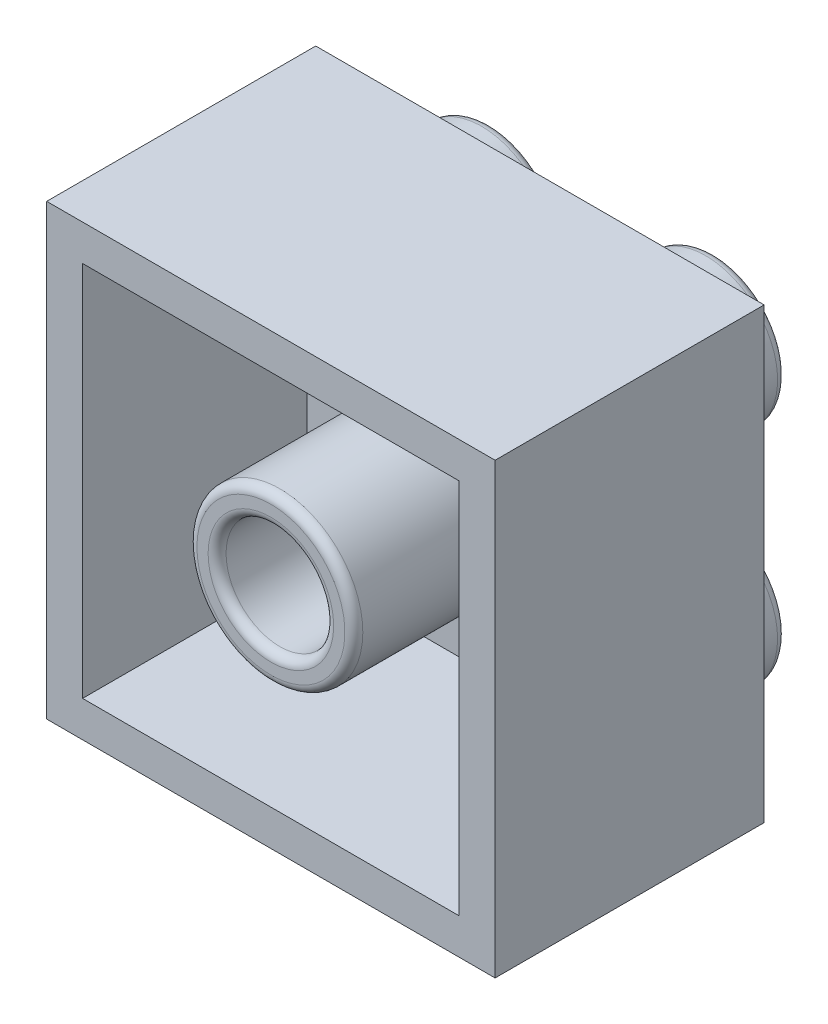
ISO-10303-21;
HEADER;
FILE_DESCRIPTION(('STEP AP214'),'2;1');
FILE_NAME('part.step','',(''),(''),'','','');
FILE_SCHEMA(('AUTOMOTIVE_DESIGN { 1 0 10303 214 1 1 1 1 }'));
ENDSEC;
DATA;
#1=APPLICATION_CONTEXT('core data for automotive mechanical design processes');
#2=APPLICATION_PROTOCOL_DEFINITION('international standard','automotive_design',2000,#1);
#3=PRODUCT_CONTEXT('',#1,'mechanical');
#4=PRODUCT('Part','Part','',(#3));
#5=PRODUCT_RELATED_PRODUCT_CATEGORY('part','',(#4));
#6=PRODUCT_DEFINITION_FORMATION('','',#4);
#7=PRODUCT_DEFINITION_CONTEXT('part definition',#1,'design');
#8=PRODUCT_DEFINITION('design','',#6,#7);
#9=PRODUCT_DEFINITION_SHAPE('','',#8);
#10=(LENGTH_UNIT() NAMED_UNIT(*) SI_UNIT(.MILLI.,.METRE.));
#11=(NAMED_UNIT(*) PLANE_ANGLE_UNIT() SI_UNIT($,.RADIAN.));
#12=(NAMED_UNIT(*) SI_UNIT($,.STERADIAN.) SOLID_ANGLE_UNIT());
#13=UNCERTAINTY_MEASURE_WITH_UNIT(LENGTH_MEASURE(1.E-05),#10,'distance_accuracy_value','');
#14=(GEOMETRIC_REPRESENTATION_CONTEXT(3) GLOBAL_UNCERTAINTY_ASSIGNED_CONTEXT((#13)) GLOBAL_UNIT_ASSIGNED_CONTEXT((#10,
#11,#12)) REPRESENTATION_CONTEXT('',''));
#15=CARTESIAN_POINT('',(0.,0.,0.));
#16=DIRECTION('',(0.,0.,1.));
#17=DIRECTION('',(1.,0.,0.));
#18=AXIS2_PLACEMENT_3D('',#15,#16,#17);
#19=CARTESIAN_POINT('',(0.,0.,60.));
#20=DIRECTION('',(0.,0.,-1.));
#21=DIRECTION('',(-1.,0.,0.));
#22=AXIS2_PLACEMENT_3D('',#19,#20,#21);
#23=PLANE('',#22);
#24=DIRECTION('',(-1.,0.,0.));
#25=VECTOR('',#24,1.);
#26=CARTESIAN_POINT('',(50.,-50.,60.));
#27=LINE('',#26,#25);
#28=CARTESIAN_POINT('',(50.,-50.,60.));
#29=VERTEX_POINT('',#28);
#30=CARTESIAN_POINT('',(-50.,-50.,60.));
#31=VERTEX_POINT('',#30);
#32=EDGE_CURVE('E180',#29,#31,#27,.T.);
#33=ORIENTED_EDGE('',*,*,#32,.F.);
#34=DIRECTION('',(0.,-1.,0.));
#35=VECTOR('',#34,1.);
#36=CARTESIAN_POINT('',(50.,50.,60.));
#37=LINE('',#36,#35);
#38=CARTESIAN_POINT('',(50.,50.,60.));
#39=VERTEX_POINT('',#38);
#40=EDGE_CURVE('E191',#39,#29,#37,.T.);
#41=ORIENTED_EDGE('',*,*,#40,.F.);
#42=DIRECTION('',(1.,0.,0.));
#43=VECTOR('',#42,1.);
#44=CARTESIAN_POINT('',(-50.,50.,60.));
#45=LINE('',#44,#43);
#46=CARTESIAN_POINT('',(-50.,50.,60.));
#47=VERTEX_POINT('',#46);
#48=EDGE_CURVE('E187',#47,#39,#45,.T.);
#49=ORIENTED_EDGE('',*,*,#48,.F.);
#50=DIRECTION('',(0.,1.,0.));
#51=VECTOR('',#50,1.);
#52=CARTESIAN_POINT('',(-50.,-50.,60.));
#53=LINE('',#52,#51);
#54=EDGE_CURVE('E183',#31,#47,#53,.T.);
#55=ORIENTED_EDGE('',*,*,#54,.F.);
#56=EDGE_LOOP('',(#33,#41,#49,#55));
#57=FACE_BOUND('',#56,.T.);
#58=DIRECTION('',(-1.,0.,0.));
#59=VECTOR('',#58,1.);
#60=CARTESIAN_POINT('',(0.,-42.,60.));
#61=LINE('',#60,#59);
#62=CARTESIAN_POINT('',(42.,-42.,60.));
#63=VERTEX_POINT('',#62);
#64=CARTESIAN_POINT('',(-42.,-42.,60.));
#65=VERTEX_POINT('',#64);
#66=EDGE_CURVE('E70',#63,#65,#61,.T.);
#67=ORIENTED_EDGE('',*,*,#66,.T.);
#68=DIRECTION('',(0.,1.,0.));
#69=VECTOR('',#68,1.);
#70=CARTESIAN_POINT('',(-42.,0.,60.));
#71=LINE('',#70,#69);
#72=CARTESIAN_POINT('',(-42.,42.,60.));
#73=VERTEX_POINT('',#72);
#74=EDGE_CURVE('E152',#65,#73,#71,.T.);
#75=ORIENTED_EDGE('',*,*,#74,.T.);
#76=DIRECTION('',(1.,0.,0.));
#77=VECTOR('',#76,1.);
#78=CARTESIAN_POINT('',(0.,42.,60.));
#79=LINE('',#78,#77);
#80=CARTESIAN_POINT('',(42.,42.,60.));
#81=VERTEX_POINT('',#80);
#82=EDGE_CURVE('E156',#73,#81,#79,.T.);
#83=ORIENTED_EDGE('',*,*,#82,.T.);
#84=DIRECTION('',(0.,-1.,0.));
#85=VECTOR('',#84,1.);
#86=CARTESIAN_POINT('',(42.,0.,60.));
#87=LINE('',#86,#85);
#88=EDGE_CURVE('E165',#81,#63,#87,.T.);
#89=ORIENTED_EDGE('',*,*,#88,.T.);
#90=EDGE_LOOP('',(#67,#75,#83,#89));
#91=FACE_BOUND('',#90,.T.);
#92=ADVANCED_FACE('F54',(#57,#91),#23,.F.);
#93=CARTESIAN_POINT('',(50.,-50.,60.));
#94=DIRECTION('',(0.,-1.,0.));
#95=DIRECTION('',(1.,0.,0.));
#96=AXIS2_PLACEMENT_3D('',#93,#94,#95);
#97=PLANE('',#96);
#98=DIRECTION('',(-1.,0.,0.));
#99=VECTOR('',#98,1.);
#100=CARTESIAN_POINT('',(50.,-50.,0.));
#101=LINE('',#100,#99);
#102=CARTESIAN_POINT('',(50.,-50.,0.));
#103=VERTEX_POINT('',#102);
#104=CARTESIAN_POINT('',(-50.,-50.,0.));
#105=VERTEX_POINT('',#104);
#106=EDGE_CURVE('E174',#103,#105,#101,.T.);
#107=ORIENTED_EDGE('',*,*,#106,.F.);
#108=DIRECTION('',(0.,0.,-1.));
#109=VECTOR('',#108,1.);
#110=CARTESIAN_POINT('',(50.,-50.,60.));
#111=LINE('',#110,#109);
#112=EDGE_CURVE('E79',#29,#103,#111,.T.);
#113=ORIENTED_EDGE('',*,*,#112,.F.);
#114=ORIENTED_EDGE('',*,*,#32,.T.);
#115=DIRECTION('',(0.,0.,-1.));
#116=VECTOR('',#115,1.);
#117=CARTESIAN_POINT('',(-50.,-50.,60.));
#118=LINE('',#117,#116);
#119=EDGE_CURVE('E105',#31,#105,#118,.T.);
#120=ORIENTED_EDGE('',*,*,#119,.T.);
#121=EDGE_LOOP('',(#107,#113,#114,#120));
#122=FACE_BOUND('',#121,.T.);
#123=ADVANCED_FACE('F326',(#122),#97,.T.);
#124=CARTESIAN_POINT('',(50.,50.,60.));
#125=DIRECTION('',(1.,0.,0.));
#126=DIRECTION('',(0.,0.,-1.));
#127=AXIS2_PLACEMENT_3D('',#124,#125,#126);
#128=PLANE('',#127);
#129=DIRECTION('',(0.,-1.,0.));
#130=VECTOR('',#129,1.);
#131=CARTESIAN_POINT('',(50.,50.,0.));
#132=LINE('',#131,#130);
#133=CARTESIAN_POINT('',(50.,50.,0.));
#134=VERTEX_POINT('',#133);
#135=EDGE_CURVE('E184',#134,#103,#132,.T.);
#136=ORIENTED_EDGE('',*,*,#135,.F.);
#137=DIRECTION('',(0.,0.,-1.));
#138=VECTOR('',#137,1.);
#139=CARTESIAN_POINT('',(50.,50.,60.));
#140=LINE('',#139,#138);
#141=EDGE_CURVE('E211',#39,#134,#140,.T.);
#142=ORIENTED_EDGE('',*,*,#141,.F.);
#143=ORIENTED_EDGE('',*,*,#40,.T.);
#144=ORIENTED_EDGE('',*,*,#112,.T.);
#145=EDGE_LOOP('',(#136,#142,#143,#144));
#146=FACE_BOUND('',#145,.T.);
#147=ADVANCED_FACE('F333',(#146),#128,.T.);
#148=CARTESIAN_POINT('',(-50.,50.,60.));
#149=DIRECTION('',(0.,1.,0.));
#150=DIRECTION('',(-1.,0.,0.));
#151=AXIS2_PLACEMENT_3D('',#148,#149,#150);
#152=PLANE('',#151);
#153=DIRECTION('',(1.,0.,0.));
#154=VECTOR('',#153,1.);
#155=CARTESIAN_POINT('',(-50.,50.,0.));
#156=LINE('',#155,#154);
#157=CARTESIAN_POINT('',(-50.,50.,0.));
#158=VERTEX_POINT('',#157);
#159=EDGE_CURVE('E201',#158,#134,#156,.T.);
#160=ORIENTED_EDGE('',*,*,#159,.F.);
#161=DIRECTION('',(0.,0.,-1.));
#162=VECTOR('',#161,1.);
#163=CARTESIAN_POINT('',(-50.,50.,60.));
#164=LINE('',#163,#162);
#165=EDGE_CURVE('E214',#47,#158,#164,.T.);
#166=ORIENTED_EDGE('',*,*,#165,.F.);
#167=ORIENTED_EDGE('',*,*,#48,.T.);
#168=ORIENTED_EDGE('',*,*,#141,.T.);
#169=EDGE_LOOP('',(#160,#166,#167,#168));
#170=FACE_BOUND('',#169,.T.);
#171=ADVANCED_FACE('F437',(#170),#152,.T.);
#172=CARTESIAN_POINT('',(-50.,-50.,60.));
#173=DIRECTION('',(-1.,0.,0.));
#174=DIRECTION('',(0.,-1.,0.));
#175=AXIS2_PLACEMENT_3D('',#172,#173,#174);
#176=PLANE('',#175);
#177=DIRECTION('',(0.,1.,0.));
#178=VECTOR('',#177,1.);
#179=CARTESIAN_POINT('',(-50.,-50.,0.));
#180=LINE('',#179,#178);
#181=EDGE_CURVE('E197',#105,#158,#180,.T.);
#182=ORIENTED_EDGE('',*,*,#181,.F.);
#183=ORIENTED_EDGE('',*,*,#119,.F.);
#184=ORIENTED_EDGE('',*,*,#54,.T.);
#185=ORIENTED_EDGE('',*,*,#165,.T.);
#186=EDGE_LOOP('',(#182,#183,#184,#185));
#187=FACE_BOUND('',#186,.T.);
#188=ADVANCED_FACE('F432',(#187),#176,.T.);
#189=CARTESIAN_POINT('',(0.,0.,0.));
#190=DIRECTION('',(0.,0.,-1.));
#191=DIRECTION('',(-1.,0.,0.));
#192=AXIS2_PLACEMENT_3D('',#189,#190,#191);
#193=PLANE('',#192);
#194=CARTESIAN_POINT('',(-25.,25.,0.));
#195=DIRECTION('',(0.,0.,-1.));
#196=DIRECTION('',(-1.,0.,0.));
#197=AXIS2_PLACEMENT_3D('',#194,#195,#196);
#198=CIRCLE('',#197,18.);
#199=CARTESIAN_POINT('',(-43.,25.,0.));
#200=VERTEX_POINT('',#199);
#201=EDGE_CURVE('E270',#200,#200,#198,.F.);
#202=ORIENTED_EDGE('',*,*,#201,.T.);
#203=EDGE_LOOP('',(#202));
#204=FACE_BOUND('',#203,.T.);
#205=CARTESIAN_POINT('',(25.,25.,0.));
#206=DIRECTION('',(0.,0.,-1.));
#207=DIRECTION('',(-1.,0.,0.));
#208=AXIS2_PLACEMENT_3D('',#205,#206,#207);
#209=CIRCLE('',#208,18.);
#210=CARTESIAN_POINT('',(7.,25.,0.));
#211=VERTEX_POINT('',#210);
#212=EDGE_CURVE('E266',#211,#211,#209,.F.);
#213=ORIENTED_EDGE('',*,*,#212,.T.);
#214=EDGE_LOOP('',(#213));
#215=FACE_BOUND('',#214,.T.);
#216=CARTESIAN_POINT('',(-24.9999999999999,-25.,0.));
#217=DIRECTION('',(0.,0.,-1.));
#218=DIRECTION('',(-1.,0.,0.));
#219=AXIS2_PLACEMENT_3D('',#216,#217,#218);
#220=CIRCLE('',#219,18.);
#221=CARTESIAN_POINT('',(-42.9999999999999,-25.,0.));
#222=VERTEX_POINT('',#221);
#223=EDGE_CURVE('E262',#222,#222,#220,.F.);
#224=ORIENTED_EDGE('',*,*,#223,.T.);
#225=EDGE_LOOP('',(#224));
#226=FACE_BOUND('',#225,.T.);
#227=CARTESIAN_POINT('',(24.9999999999999,-25.,0.));
#228=DIRECTION('',(0.,0.,-1.));
#229=DIRECTION('',(-1.,0.,0.));
#230=AXIS2_PLACEMENT_3D('',#227,#228,#229);
#231=CIRCLE('',#230,18.);
#232=CARTESIAN_POINT('',(6.99999999999994,-25.,0.));
#233=VERTEX_POINT('',#232);
#234=EDGE_CURVE('E258',#233,#233,#231,.F.);
#235=ORIENTED_EDGE('',*,*,#234,.T.);
#236=EDGE_LOOP('',(#235));
#237=FACE_BOUND('',#236,.T.);
#238=ORIENTED_EDGE('',*,*,#106,.T.);
#239=ORIENTED_EDGE('',*,*,#181,.T.);
#240=ORIENTED_EDGE('',*,*,#159,.T.);
#241=ORIENTED_EDGE('',*,*,#135,.T.);
#242=EDGE_LOOP('',(#238,#239,#240,#241));
#243=FACE_BOUND('',#242,.T.);
#244=ADVANCED_FACE('F428',(#204,#215,#226,#237,#243),#193,.T.);
#245=CARTESIAN_POINT('',(24.9999999999999,-25.,-14.));
#246=DIRECTION('',(0.,0.,1.));
#247=DIRECTION('',(1.,0.,0.));
#248=AXIS2_PLACEMENT_3D('',#245,#246,#247);
#249=CYLINDRICAL_SURFACE('',#248,16.);
#250=CARTESIAN_POINT('',(24.9999999999999,-25.,-2.));
#251=DIRECTION('',(0.,0.,-1.));
#252=DIRECTION('',(-1.,0.,0.));
#253=AXIS2_PLACEMENT_3D('',#250,#251,#252);
#254=CIRCLE('',#253,16.);
#255=CARTESIAN_POINT('',(8.99999999999994,-25.,-2.));
#256=VERTEX_POINT('',#255);
#257=EDGE_CURVE('E63',#256,#256,#254,.T.);
#258=ORIENTED_EDGE('',*,*,#257,.T.);
#259=EDGE_LOOP('',(#258));
#260=FACE_BOUND('',#259,.T.);
#261=CARTESIAN_POINT('',(24.9999999999999,-25.,-12.));
#262=DIRECTION('',(0.,0.,1.));
#263=DIRECTION('',(1.,0.,0.));
#264=AXIS2_PLACEMENT_3D('',#261,#262,#263);
#265=CIRCLE('',#264,16.);
#266=CARTESIAN_POINT('',(40.9999999999999,-25.,-12.));
#267=VERTEX_POINT('',#266);
#268=EDGE_CURVE('E302',#267,#267,#265,.T.);
#269=ORIENTED_EDGE('',*,*,#268,.T.);
#270=EDGE_LOOP('',(#269));
#271=FACE_BOUND('',#270,.T.);
#272=ADVANCED_FACE('F309',(#260,#271),#249,.T.);
#273=CARTESIAN_POINT('',(24.9999999999999,-25.,-14.));
#274=DIRECTION('',(0.,0.,1.));
#275=DIRECTION('',(1.,0.,0.));
#276=AXIS2_PLACEMENT_3D('',#273,#274,#275);
#277=PLANE('',#276);
#278=CARTESIAN_POINT('',(24.9999999999999,-25.,-14.));
#279=DIRECTION('',(0.,0.,1.));
#280=DIRECTION('',(1.,0.,0.));
#281=AXIS2_PLACEMENT_3D('',#278,#279,#280);
#282=CIRCLE('',#281,14.);
#283=CARTESIAN_POINT('',(38.9999999999999,-25.,-14.));
#284=VERTEX_POINT('',#283);
#285=EDGE_CURVE('E12',#284,#284,#282,.F.);
#286=ORIENTED_EDGE('',*,*,#285,.T.);
#287=EDGE_LOOP('',(#286));
#288=FACE_BOUND('',#287,.T.);
#289=ADVANCED_FACE('F423',(#288),#277,.F.);
#290=CARTESIAN_POINT('',(-25.,25.,-14.));
#291=DIRECTION('',(0.,0.,1.));
#292=DIRECTION('',(1.,0.,0.));
#293=AXIS2_PLACEMENT_3D('',#290,#291,#292);
#294=CYLINDRICAL_SURFACE('',#293,16.);
#295=CARTESIAN_POINT('',(-25.,25.,-2.));
#296=DIRECTION('',(0.,0.,-1.));
#297=DIRECTION('',(-1.,0.,0.));
#298=AXIS2_PLACEMENT_3D('',#295,#296,#297);
#299=CIRCLE('',#298,16.);
#300=CARTESIAN_POINT('',(-41.,25.,-2.));
#301=VERTEX_POINT('',#300);
#302=EDGE_CURVE('E254',#301,#301,#299,.T.);
#303=ORIENTED_EDGE('',*,*,#302,.T.);
#304=EDGE_LOOP('',(#303));
#305=FACE_BOUND('',#304,.T.);
#306=CARTESIAN_POINT('',(-25.,25.,-12.));
#307=DIRECTION('',(0.,0.,1.));
#308=DIRECTION('',(1.,0.,0.));
#309=AXIS2_PLACEMENT_3D('',#306,#307,#308);
#310=CIRCLE('',#309,16.);
#311=CARTESIAN_POINT('',(-8.99999999999999,25.,-12.));
#312=VERTEX_POINT('',#311);
#313=EDGE_CURVE('E250',#312,#312,#310,.T.);
#314=ORIENTED_EDGE('',*,*,#313,.T.);
#315=EDGE_LOOP('',(#314));
#316=FACE_BOUND('',#315,.T.);
#317=ADVANCED_FACE('F419',(#305,#316),#294,.T.);
#318=CARTESIAN_POINT('',(-25.,25.,-14.));
#319=DIRECTION('',(0.,0.,1.));
#320=DIRECTION('',(1.,0.,0.));
#321=AXIS2_PLACEMENT_3D('',#318,#319,#320);
#322=PLANE('',#321);
#323=CARTESIAN_POINT('',(-25.,25.,-14.));
#324=DIRECTION('',(0.,0.,1.));
#325=DIRECTION('',(1.,0.,0.));
#326=AXIS2_PLACEMENT_3D('',#323,#324,#325);
#327=CIRCLE('',#326,14.);
#328=CARTESIAN_POINT('',(-11.,25.,-14.));
#329=VERTEX_POINT('',#328);
#330=EDGE_CURVE('E274',#329,#329,#327,.F.);
#331=ORIENTED_EDGE('',*,*,#330,.T.);
#332=EDGE_LOOP('',(#331));
#333=FACE_BOUND('',#332,.T.);
#334=ADVANCED_FACE('F400',(#333),#322,.F.);
#335=CARTESIAN_POINT('',(-24.9999999999999,-25.,-14.));
#336=DIRECTION('',(0.,0.,1.));
#337=DIRECTION('',(1.,0.,0.));
#338=AXIS2_PLACEMENT_3D('',#335,#336,#337);
#339=CYLINDRICAL_SURFACE('',#338,16.);
#340=CARTESIAN_POINT('',(-24.9999999999999,-25.,-2.));
#341=DIRECTION('',(0.,0.,-1.));
#342=DIRECTION('',(-1.,0.,0.));
#343=AXIS2_PLACEMENT_3D('',#340,#341,#342);
#344=CIRCLE('',#343,16.);
#345=CARTESIAN_POINT('',(-40.9999999999999,-25.,-2.));
#346=VERTEX_POINT('',#345);
#347=EDGE_CURVE('E294',#346,#346,#344,.T.);
#348=ORIENTED_EDGE('',*,*,#347,.T.);
#349=EDGE_LOOP('',(#348));
#350=FACE_BOUND('',#349,.T.);
#351=CARTESIAN_POINT('',(-24.9999999999999,-25.,-12.));
#352=DIRECTION('',(0.,0.,-1.));
#353=DIRECTION('',(-1.,0.,0.));
#354=AXIS2_PLACEMENT_3D('',#351,#352,#353);
#355=CIRCLE('',#354,16.);
#356=CARTESIAN_POINT('',(-40.9999999999999,-25.,-12.));
#357=VERTEX_POINT('',#356);
#358=EDGE_CURVE('E290',#357,#357,#355,.F.);
#359=ORIENTED_EDGE('',*,*,#358,.T.);
#360=EDGE_LOOP('',(#359));
#361=FACE_BOUND('',#360,.T.);
#362=ADVANCED_FACE('F396',(#350,#361),#339,.T.);
#363=CARTESIAN_POINT('',(-24.9999999999999,-25.,-14.));
#364=DIRECTION('',(0.,0.,-1.));
#365=DIRECTION('',(-1.,0.,0.));
#366=AXIS2_PLACEMENT_3D('',#363,#364,#365);
#367=PLANE('',#366);
#368=CARTESIAN_POINT('',(-24.9999999999999,-25.,-14.));
#369=DIRECTION('',(0.,0.,-1.));
#370=DIRECTION('',(-1.,0.,0.));
#371=AXIS2_PLACEMENT_3D('',#368,#369,#370);
#372=CIRCLE('',#371,14.);
#373=CARTESIAN_POINT('',(-38.9999999999999,-25.,-14.));
#374=VERTEX_POINT('',#373);
#375=EDGE_CURVE('E298',#374,#374,#372,.T.);
#376=ORIENTED_EDGE('',*,*,#375,.T.);
#377=EDGE_LOOP('',(#376));
#378=FACE_BOUND('',#377,.T.);
#379=ADVANCED_FACE('F399',(#378),#367,.T.);
#380=CARTESIAN_POINT('',(25.,25.,-14.));
#381=DIRECTION('',(0.,0.,1.));
#382=DIRECTION('',(1.,0.,0.));
#383=AXIS2_PLACEMENT_3D('',#380,#381,#382);
#384=CYLINDRICAL_SURFACE('',#383,16.);
#385=CARTESIAN_POINT('',(25.,25.,-2.));
#386=DIRECTION('',(0.,0.,-1.));
#387=DIRECTION('',(-1.,0.,0.));
#388=AXIS2_PLACEMENT_3D('',#385,#386,#387);
#389=CIRCLE('',#388,16.);
#390=CARTESIAN_POINT('',(9.,25.,-2.));
#391=VERTEX_POINT('',#390);
#392=EDGE_CURVE('E282',#391,#391,#389,.T.);
#393=ORIENTED_EDGE('',*,*,#392,.T.);
#394=EDGE_LOOP('',(#393));
#395=FACE_BOUND('',#394,.T.);
#396=CARTESIAN_POINT('',(25.,25.,-12.));
#397=DIRECTION('',(0.,0.,-1.));
#398=DIRECTION('',(-1.,0.,0.));
#399=AXIS2_PLACEMENT_3D('',#396,#397,#398);
#400=CIRCLE('',#399,16.);
#401=CARTESIAN_POINT('',(9.,25.,-12.));
#402=VERTEX_POINT('',#401);
#403=EDGE_CURVE('E278',#402,#402,#400,.F.);
#404=ORIENTED_EDGE('',*,*,#403,.T.);
#405=EDGE_LOOP('',(#404));
#406=FACE_BOUND('',#405,.T.);
#407=ADVANCED_FACE('F407',(#395,#406),#384,.T.);
#408=CARTESIAN_POINT('',(25.,25.,-14.));
#409=DIRECTION('',(0.,0.,-1.));
#410=DIRECTION('',(-1.,0.,0.));
#411=AXIS2_PLACEMENT_3D('',#408,#409,#410);
#412=PLANE('',#411);
#413=CARTESIAN_POINT('',(25.,25.,-14.));
#414=DIRECTION('',(0.,0.,-1.));
#415=DIRECTION('',(-1.,0.,0.));
#416=AXIS2_PLACEMENT_3D('',#413,#414,#415);
#417=CIRCLE('',#416,14.);
#418=CARTESIAN_POINT('',(11.,25.,-14.));
#419=VERTEX_POINT('',#418);
#420=EDGE_CURVE('E286',#419,#419,#417,.T.);
#421=ORIENTED_EDGE('',*,*,#420,.T.);
#422=EDGE_LOOP('',(#421));
#423=FACE_BOUND('',#422,.T.);
#424=ADVANCED_FACE('F412',(#423),#412,.T.);
#425=CARTESIAN_POINT('',(0.,-42.,9.99999999999999));
#426=DIRECTION('',(0.,1.,0.));
#427=DIRECTION('',(0.,0.,1.));
#428=AXIS2_PLACEMENT_3D('',#425,#426,#427);
#429=PLANE('',#428);
#430=ORIENTED_EDGE('',*,*,#66,.F.);
#431=DIRECTION('',(0.,0.,1.));
#432=VECTOR('',#431,1.);
#433=CARTESIAN_POINT('',(42.,-42.,9.99999999999999));
#434=LINE('',#433,#432);
#435=CARTESIAN_POINT('',(42.,-42.,9.99999999999999));
#436=VERTEX_POINT('',#435);
#437=EDGE_CURVE('E134',#436,#63,#434,.T.);
#438=ORIENTED_EDGE('',*,*,#437,.F.);
#439=DIRECTION('',(-1.,0.,0.));
#440=VECTOR('',#439,1.);
#441=CARTESIAN_POINT('',(0.,-42.,9.99999999999999));
#442=LINE('',#441,#440);
#443=CARTESIAN_POINT('',(-42.,-42.,9.99999999999999));
#444=VERTEX_POINT('',#443);
#445=EDGE_CURVE('E142',#436,#444,#442,.T.);
#446=ORIENTED_EDGE('',*,*,#445,.T.);
#447=DIRECTION('',(0.,0.,1.));
#448=VECTOR('',#447,1.);
#449=CARTESIAN_POINT('',(-42.,-42.,9.99999999999999));
#450=LINE('',#449,#448);
#451=EDGE_CURVE('E171',#444,#65,#450,.T.);
#452=ORIENTED_EDGE('',*,*,#451,.T.);
#453=EDGE_LOOP('',(#430,#438,#446,#452));
#454=FACE_BOUND('',#453,.T.);
#455=ADVANCED_FACE('F145',(#454),#429,.T.);
#456=CARTESIAN_POINT('',(-42.,0.,9.99999999999999));
#457=DIRECTION('',(1.,0.,0.));
#458=DIRECTION('',(0.,0.,-1.));
#459=AXIS2_PLACEMENT_3D('',#456,#457,#458);
#460=PLANE('',#459);
#461=ORIENTED_EDGE('',*,*,#74,.F.);
#462=ORIENTED_EDGE('',*,*,#451,.F.);
#463=DIRECTION('',(0.,1.,0.));
#464=VECTOR('',#463,1.);
#465=CARTESIAN_POINT('',(-42.,0.,9.99999999999999));
#466=LINE('',#465,#464);
#467=CARTESIAN_POINT('',(-42.,42.,9.99999999999999));
#468=VERTEX_POINT('',#467);
#469=EDGE_CURVE('E148',#444,#468,#466,.T.);
#470=ORIENTED_EDGE('',*,*,#469,.T.);
#471=DIRECTION('',(0.,0.,1.));
#472=VECTOR('',#471,1.);
#473=CARTESIAN_POINT('',(-42.,42.,9.99999999999999));
#474=LINE('',#473,#472);
#475=EDGE_CURVE('E175',#468,#73,#474,.T.);
#476=ORIENTED_EDGE('',*,*,#475,.T.);
#477=EDGE_LOOP('',(#461,#462,#470,#476));
#478=FACE_BOUND('',#477,.T.);
#479=ADVANCED_FACE('F461',(#478),#460,.T.);
#480=CARTESIAN_POINT('',(0.,42.,9.99999999999999));
#481=DIRECTION('',(0.,-1.,0.));
#482=DIRECTION('',(0.,0.,-1.));
#483=AXIS2_PLACEMENT_3D('',#480,#481,#482);
#484=PLANE('',#483);
#485=ORIENTED_EDGE('',*,*,#82,.F.);
#486=ORIENTED_EDGE('',*,*,#475,.F.);
#487=DIRECTION('',(1.,0.,0.));
#488=VECTOR('',#487,1.);
#489=CARTESIAN_POINT('',(0.,42.,9.99999999999999));
#490=LINE('',#489,#488);
#491=CARTESIAN_POINT('',(42.,42.,9.99999999999999));
#492=VERTEX_POINT('',#491);
#493=EDGE_CURVE('E141',#468,#492,#490,.T.);
#494=ORIENTED_EDGE('',*,*,#493,.T.);
#495=DIRECTION('',(0.,0.,1.));
#496=VECTOR('',#495,1.);
#497=CARTESIAN_POINT('',(42.,42.,9.99999999999999));
#498=LINE('',#497,#496);
#499=EDGE_CURVE('E136',#492,#81,#498,.T.);
#500=ORIENTED_EDGE('',*,*,#499,.T.);
#501=EDGE_LOOP('',(#485,#486,#494,#500));
#502=FACE_BOUND('',#501,.T.);
#503=ADVANCED_FACE('F464',(#502),#484,.T.);
#504=CARTESIAN_POINT('',(0.,0.,9.99999999999999));
#505=DIRECTION('',(0.,0.,1.));
#506=DIRECTION('',(1.,0.,0.));
#507=AXIS2_PLACEMENT_3D('',#504,#505,#506);
#508=CYLINDRICAL_SURFACE('',#507,18.5);
#509=CARTESIAN_POINT('',(0.,0.,58.));
#510=DIRECTION('',(0.,0.,-1.));
#511=DIRECTION('',(-1.,0.,0.));
#512=AXIS2_PLACEMENT_3D('',#509,#510,#511);
#513=CIRCLE('',#512,18.5);
#514=CARTESIAN_POINT('',(-18.5,0.,58.));
#515=VERTEX_POINT('',#514);
#516=EDGE_CURVE('E242',#515,#515,#513,.T.);
#517=ORIENTED_EDGE('',*,*,#516,.T.);
#518=EDGE_LOOP('',(#517));
#519=FACE_BOUND('',#518,.T.);
#520=CARTESIAN_POINT('',(0.,0.,12.));
#521=DIRECTION('',(0.,0.,1.));
#522=DIRECTION('',(1.,0.,0.));
#523=AXIS2_PLACEMENT_3D('',#520,#521,#522);
#524=CIRCLE('',#523,18.5);
#525=CARTESIAN_POINT('',(18.5,0.,12.));
#526=VERTEX_POINT('',#525);
#527=EDGE_CURVE('E238',#526,#526,#524,.T.);
#528=ORIENTED_EDGE('',*,*,#527,.T.);
#529=EDGE_LOOP('',(#528));
#530=FACE_BOUND('',#529,.T.);
#531=ADVANCED_FACE('F468',(#519,#530),#508,.T.);
#532=CARTESIAN_POINT('',(42.,0.,9.99999999999999));
#533=DIRECTION('',(-1.,0.,0.));
#534=DIRECTION('',(0.,0.,1.));
#535=AXIS2_PLACEMENT_3D('',#532,#533,#534);
#536=PLANE('',#535);
#537=ORIENTED_EDGE('',*,*,#88,.F.);
#538=ORIENTED_EDGE('',*,*,#499,.F.);
#539=DIRECTION('',(0.,-1.,0.));
#540=VECTOR('',#539,1.);
#541=CARTESIAN_POINT('',(42.,0.,9.99999999999999));
#542=LINE('',#541,#540);
#543=EDGE_CURVE('E131',#492,#436,#542,.T.);
#544=ORIENTED_EDGE('',*,*,#543,.T.);
#545=ORIENTED_EDGE('',*,*,#437,.T.);
#546=EDGE_LOOP('',(#537,#538,#544,#545));
#547=FACE_BOUND('',#546,.T.);
#548=ADVANCED_FACE('F133',(#547),#536,.T.);
#549=CARTESIAN_POINT('',(0.,0.,9.99999999999999));
#550=DIRECTION('',(0.,0.,1.));
#551=DIRECTION('',(1.,0.,0.));
#552=AXIS2_PLACEMENT_3D('',#549,#550,#551);
#553=PLANE('',#552);
#554=CARTESIAN_POINT('',(0.,0.,9.99999999999999));
#555=DIRECTION('',(0.,0.,1.));
#556=DIRECTION('',(1.,0.,0.));
#557=AXIS2_PLACEMENT_3D('',#554,#555,#556);
#558=CIRCLE('',#557,20.5);
#559=CARTESIAN_POINT('',(20.5,0.,9.99999999999999));
#560=VERTEX_POINT('',#559);
#561=EDGE_CURVE('E246',#560,#560,#558,.F.);
#562=ORIENTED_EDGE('',*,*,#561,.T.);
#563=EDGE_LOOP('',(#562));
#564=FACE_BOUND('',#563,.T.);
#565=ORIENTED_EDGE('',*,*,#445,.F.);
#566=ORIENTED_EDGE('',*,*,#543,.F.);
#567=ORIENTED_EDGE('',*,*,#493,.F.);
#568=ORIENTED_EDGE('',*,*,#469,.F.);
#569=EDGE_LOOP('',(#565,#566,#567,#568));
#570=FACE_BOUND('',#569,.T.);
#571=ADVANCED_FACE('F150',(#564,#570),#553,.T.);
#572=CARTESIAN_POINT('',(0.,0.,60.));
#573=DIRECTION('',(0.,0.,-1.));
#574=DIRECTION('',(-1.,0.,0.));
#575=AXIS2_PLACEMENT_3D('',#572,#573,#574);
#576=CIRCLE('',#575,14.);
#577=CARTESIAN_POINT('',(-14.,0.,60.));
#578=VERTEX_POINT('',#577);
#579=EDGE_CURVE('E234',#578,#578,#576,.T.);
#580=ORIENTED_EDGE('',*,*,#579,.T.);
#581=EDGE_LOOP('',(#580));
#582=FACE_BOUND('',#581,.T.);
#583=CARTESIAN_POINT('',(0.,0.,60.));
#584=DIRECTION('',(0.,0.,-1.));
#585=DIRECTION('',(-1.,0.,0.));
#586=AXIS2_PLACEMENT_3D('',#583,#584,#585);
#587=CIRCLE('',#586,16.5);
#588=CARTESIAN_POINT('',(-16.5,0.,60.));
#589=VERTEX_POINT('',#588);
#590=EDGE_CURVE('E230',#589,#589,#587,.F.);
#591=ORIENTED_EDGE('',*,*,#590,.T.);
#592=EDGE_LOOP('',(#591));
#593=FACE_BOUND('',#592,.T.);
#594=ADVANCED_FACE('F329',(#582,#593),#23,.F.);
#595=CARTESIAN_POINT('',(0.,0.,9.99999999999999));
#596=DIRECTION('',(0.,0.,1.));
#597=DIRECTION('',(1.,0.,0.));
#598=AXIS2_PLACEMENT_3D('',#595,#596,#597);
#599=CYLINDRICAL_SURFACE('',#598,12.);
#600=CARTESIAN_POINT('',(0.,0.,12.));
#601=DIRECTION('',(0.,0.,1.));
#602=DIRECTION('',(1.,0.,0.));
#603=AXIS2_PLACEMENT_3D('',#600,#601,#602);
#604=CIRCLE('',#603,12.);
#605=CARTESIAN_POINT('',(12.,0.,12.));
#606=VERTEX_POINT('',#605);
#607=EDGE_CURVE('E226',#606,#606,#604,.F.);
#608=ORIENTED_EDGE('',*,*,#607,.T.);
#609=EDGE_LOOP('',(#608));
#610=FACE_BOUND('',#609,.T.);
#611=CARTESIAN_POINT('',(0.,0.,58.));
#612=DIRECTION('',(0.,0.,-1.));
#613=DIRECTION('',(-1.,0.,0.));
#614=AXIS2_PLACEMENT_3D('',#611,#612,#613);
#615=CIRCLE('',#614,12.);
#616=CARTESIAN_POINT('',(-12.,0.,58.));
#617=VERTEX_POINT('',#616);
#618=EDGE_CURVE('E222',#617,#617,#615,.F.);
#619=ORIENTED_EDGE('',*,*,#618,.T.);
#620=EDGE_LOOP('',(#619));
#621=FACE_BOUND('',#620,.T.);
#622=ADVANCED_FACE('F339',(#610,#621),#599,.F.);
#623=CARTESIAN_POINT('',(0.,0.,9.99999999999999));
#624=DIRECTION('',(0.,0.,1.));
#625=DIRECTION('',(1.,0.,0.));
#626=AXIS2_PLACEMENT_3D('',#623,#624,#625);
#627=PLANE('',#626);
#628=CARTESIAN_POINT('',(0.,0.,9.99999999999999));
#629=DIRECTION('',(0.,0.,1.));
#630=DIRECTION('',(1.,0.,0.));
#631=AXIS2_PLACEMENT_3D('',#628,#629,#630);
#632=CIRCLE('',#631,10.);
#633=CARTESIAN_POINT('',(10.,0.,9.99999999999999));
#634=VERTEX_POINT('',#633);
#635=EDGE_CURVE('E210',#634,#634,#632,.T.);
#636=ORIENTED_EDGE('',*,*,#635,.T.);
#637=EDGE_LOOP('',(#636));
#638=FACE_BOUND('',#637,.T.);
#639=ADVANCED_FACE('F345',(#638),#627,.T.);
#640=CARTESIAN_POINT('',(0.,0.,12.));
#641=DIRECTION('',(0.,0.,1.));
#642=DIRECTION('',(1.,0.,0.));
#643=AXIS2_PLACEMENT_3D('',#640,#641,#642);
#644=TOROIDAL_SURFACE('',#643,10.,2.);
#645=ORIENTED_EDGE('',*,*,#607,.F.);
#646=EDGE_LOOP('',(#645));
#647=FACE_BOUND('',#646,.T.);
#648=ORIENTED_EDGE('',*,*,#635,.F.);
#649=EDGE_LOOP('',(#648));
#650=FACE_BOUND('',#649,.T.);
#651=ADVANCED_FACE('F367',(#647,#650),#644,.F.);
#652=CARTESIAN_POINT('',(0.,0.,58.));
#653=DIRECTION('',(0.,0.,-1.));
#654=DIRECTION('',(-1.,0.,0.));
#655=AXIS2_PLACEMENT_3D('',#652,#653,#654);
#656=TOROIDAL_SURFACE('',#655,14.,2.);
#657=ORIENTED_EDGE('',*,*,#579,.F.);
#658=EDGE_LOOP('',(#657));
#659=FACE_BOUND('',#658,.T.);
#660=ORIENTED_EDGE('',*,*,#618,.F.);
#661=EDGE_LOOP('',(#660));
#662=FACE_BOUND('',#661,.T.);
#663=ADVANCED_FACE('F357',(#659,#662),#656,.T.);
#664=CARTESIAN_POINT('',(0.,0.,58.));
#665=DIRECTION('',(0.,0.,-1.));
#666=DIRECTION('',(-1.,0.,0.));
#667=AXIS2_PLACEMENT_3D('',#664,#665,#666);
#668=TOROIDAL_SURFACE('',#667,16.5,2.);
#669=ORIENTED_EDGE('',*,*,#516,.F.);
#670=EDGE_LOOP('',(#669));
#671=FACE_BOUND('',#670,.T.);
#672=ORIENTED_EDGE('',*,*,#590,.F.);
#673=EDGE_LOOP('',(#672));
#674=FACE_BOUND('',#673,.T.);
#675=ADVANCED_FACE('F354',(#671,#674),#668,.T.);
#676=CARTESIAN_POINT('',(0.,0.,12.));
#677=DIRECTION('',(0.,0.,1.));
#678=DIRECTION('',(1.,0.,0.));
#679=AXIS2_PLACEMENT_3D('',#676,#677,#678);
#680=TOROIDAL_SURFACE('',#679,20.5,2.);
#681=ORIENTED_EDGE('',*,*,#561,.F.);
#682=EDGE_LOOP('',(#681));
#683=FACE_BOUND('',#682,.T.);
#684=ORIENTED_EDGE('',*,*,#527,.F.);
#685=EDGE_LOOP('',(#684));
#686=FACE_BOUND('',#685,.T.);
#687=ADVANCED_FACE('F356',(#683,#686),#680,.F.);
#688=CARTESIAN_POINT('',(-25.,25.,-2.));
#689=DIRECTION('',(0.,0.,-1.));
#690=DIRECTION('',(-1.,0.,0.));
#691=AXIS2_PLACEMENT_3D('',#688,#689,#690);
#692=TOROIDAL_SURFACE('',#691,18.,2.);
#693=ORIENTED_EDGE('',*,*,#201,.F.);
#694=EDGE_LOOP('',(#693));
#695=FACE_BOUND('',#694,.T.);
#696=ORIENTED_EDGE('',*,*,#302,.F.);
#697=EDGE_LOOP('',(#696));
#698=FACE_BOUND('',#697,.T.);
#699=ADVANCED_FACE('F364',(#695,#698),#692,.F.);
#700=CARTESIAN_POINT('',(-25.,25.,-12.));
#701=DIRECTION('',(0.,0.,1.));
#702=DIRECTION('',(1.,0.,0.));
#703=AXIS2_PLACEMENT_3D('',#700,#701,#702);
#704=TOROIDAL_SURFACE('',#703,14.,2.);
#705=ORIENTED_EDGE('',*,*,#313,.F.);
#706=EDGE_LOOP('',(#705));
#707=FACE_BOUND('',#706,.T.);
#708=ORIENTED_EDGE('',*,*,#330,.F.);
#709=EDGE_LOOP('',(#708));
#710=FACE_BOUND('',#709,.T.);
#711=ADVANCED_FACE('F375',(#707,#710),#704,.T.);
#712=CARTESIAN_POINT('',(25.,25.,-2.));
#713=DIRECTION('',(0.,0.,-1.));
#714=DIRECTION('',(-1.,0.,0.));
#715=AXIS2_PLACEMENT_3D('',#712,#713,#714);
#716=TOROIDAL_SURFACE('',#715,18.,2.);
#717=ORIENTED_EDGE('',*,*,#212,.F.);
#718=EDGE_LOOP('',(#717));
#719=FACE_BOUND('',#718,.T.);
#720=ORIENTED_EDGE('',*,*,#392,.F.);
#721=EDGE_LOOP('',(#720));
#722=FACE_BOUND('',#721,.T.);
#723=ADVANCED_FACE('F379',(#719,#722),#716,.F.);
#724=CARTESIAN_POINT('',(25.,25.,-12.));
#725=DIRECTION('',(0.,0.,-1.));
#726=DIRECTION('',(-1.,0.,0.));
#727=AXIS2_PLACEMENT_3D('',#724,#725,#726);
#728=TOROIDAL_SURFACE('',#727,14.,2.);
#729=ORIENTED_EDGE('',*,*,#403,.F.);
#730=EDGE_LOOP('',(#729));
#731=FACE_BOUND('',#730,.T.);
#732=ORIENTED_EDGE('',*,*,#420,.F.);
#733=EDGE_LOOP('',(#732));
#734=FACE_BOUND('',#733,.T.);
#735=ADVANCED_FACE('F383',(#731,#734),#728,.T.);
#736=CARTESIAN_POINT('',(-24.9999999999999,-25.,-2.));
#737=DIRECTION('',(0.,0.,-1.));
#738=DIRECTION('',(-1.,0.,0.));
#739=AXIS2_PLACEMENT_3D('',#736,#737,#738);
#740=TOROIDAL_SURFACE('',#739,18.,2.);
#741=ORIENTED_EDGE('',*,*,#223,.F.);
#742=EDGE_LOOP('',(#741));
#743=FACE_BOUND('',#742,.T.);
#744=ORIENTED_EDGE('',*,*,#347,.F.);
#745=EDGE_LOOP('',(#744));
#746=FACE_BOUND('',#745,.T.);
#747=ADVANCED_FACE('F321',(#743,#746),#740,.F.);
#748=CARTESIAN_POINT('',(-24.9999999999999,-25.,-12.));
#749=DIRECTION('',(0.,0.,-1.));
#750=DIRECTION('',(-1.,0.,0.));
#751=AXIS2_PLACEMENT_3D('',#748,#749,#750);
#752=TOROIDAL_SURFACE('',#751,14.,2.);
#753=ORIENTED_EDGE('',*,*,#358,.F.);
#754=EDGE_LOOP('',(#753));
#755=FACE_BOUND('',#754,.T.);
#756=ORIENTED_EDGE('',*,*,#375,.F.);
#757=EDGE_LOOP('',(#756));
#758=FACE_BOUND('',#757,.T.);
#759=ADVANCED_FACE('F314',(#755,#758),#752,.T.);
#760=CARTESIAN_POINT('',(24.9999999999999,-25.,-2.));
#761=DIRECTION('',(0.,0.,-1.));
#762=DIRECTION('',(-1.,0.,0.));
#763=AXIS2_PLACEMENT_3D('',#760,#761,#762);
#764=TOROIDAL_SURFACE('',#763,18.,2.);
#765=ORIENTED_EDGE('',*,*,#234,.F.);
#766=EDGE_LOOP('',(#765));
#767=FACE_BOUND('',#766,.T.);
#768=ORIENTED_EDGE('',*,*,#257,.F.);
#769=EDGE_LOOP('',(#768));
#770=FACE_BOUND('',#769,.T.);
#771=ADVANCED_FACE('F312',(#767,#770),#764,.F.);
#772=CARTESIAN_POINT('',(24.9999999999999,-25.,-12.));
#773=DIRECTION('',(0.,0.,1.));
#774=DIRECTION('',(1.,0.,0.));
#775=AXIS2_PLACEMENT_3D('',#772,#773,#774);
#776=TOROIDAL_SURFACE('',#775,14.,2.);
#777=ORIENTED_EDGE('',*,*,#268,.F.);
#778=EDGE_LOOP('',(#777));
#779=FACE_BOUND('',#778,.T.);
#780=ORIENTED_EDGE('',*,*,#285,.F.);
#781=EDGE_LOOP('',(#780));
#782=FACE_BOUND('',#781,.T.);
#783=ADVANCED_FACE('F56',(#779,#782),#776,.T.);
#784=CLOSED_SHELL('',(#92,#123,#147,#171,#188,#244,#272,#289,#317,#334,#362,#379,#407,#424,#455,
#479,#503,#531,#548,#571,#594,#622,#639,#651,#663,#675,#687,#699,#711,#723,#735,#747,#759,#771,#783));
#785=MANIFOLD_SOLID_BREP('B2',#784);
#786=ADVANCED_BREP_SHAPE_REPRESENTATION('',(#18,#785),#14);
#787=SHAPE_DEFINITION_REPRESENTATION(#9,#786);
ENDSEC;
END-ISO-10303-21;
